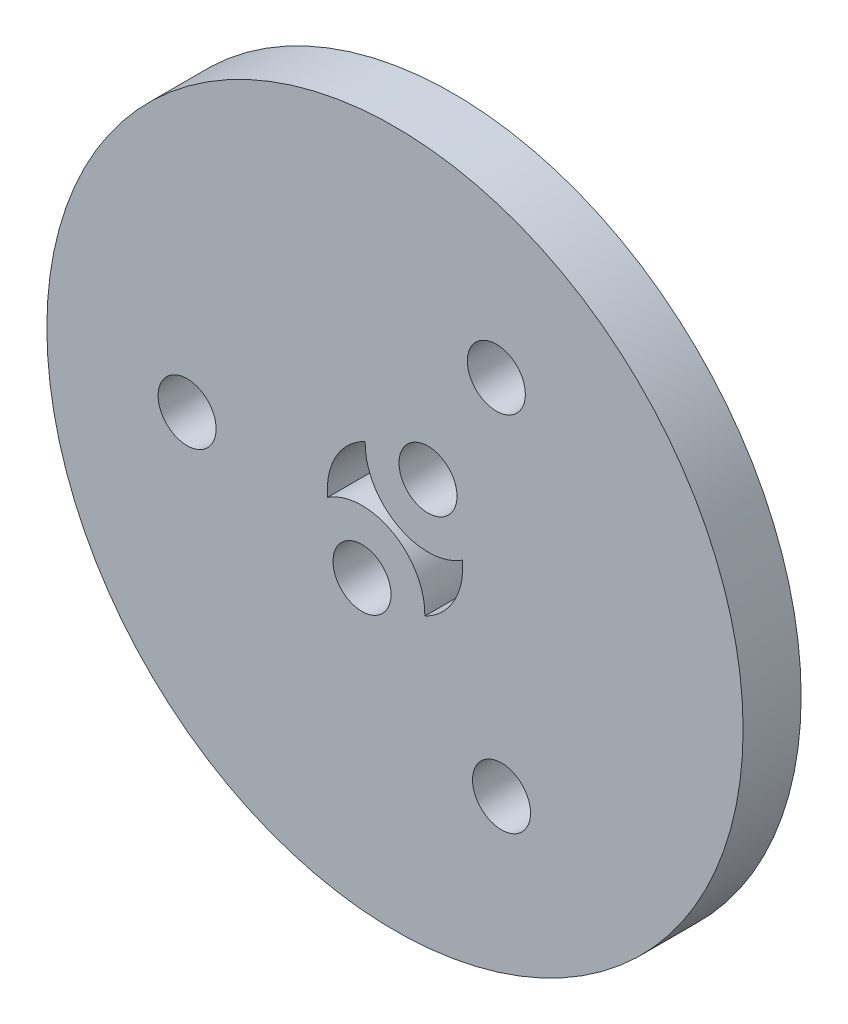
ISO-10303-21;
HEADER;
FILE_DESCRIPTION(('STEP AP214'),'2;1');
FILE_NAME('part.step','',(''),(''),'','','');
FILE_SCHEMA(('AUTOMOTIVE_DESIGN { 1 0 10303 214 1 1 1 1 }'));
ENDSEC;
DATA;
#1=APPLICATION_CONTEXT('core data for automotive mechanical design processes');
#2=APPLICATION_PROTOCOL_DEFINITION('international standard','automotive_design',2000,#1);
#3=PRODUCT_CONTEXT('',#1,'mechanical');
#4=PRODUCT('Part','Part','',(#3));
#5=PRODUCT_RELATED_PRODUCT_CATEGORY('part','',(#4));
#6=PRODUCT_DEFINITION_FORMATION('','',#4);
#7=PRODUCT_DEFINITION_CONTEXT('part definition',#1,'design');
#8=PRODUCT_DEFINITION('design','',#6,#7);
#9=PRODUCT_DEFINITION_SHAPE('','',#8);
#10=(LENGTH_UNIT() NAMED_UNIT(*) SI_UNIT(.MILLI.,.METRE.));
#11=(NAMED_UNIT(*) PLANE_ANGLE_UNIT() SI_UNIT($,.RADIAN.));
#12=(NAMED_UNIT(*) SI_UNIT($,.STERADIAN.) SOLID_ANGLE_UNIT());
#13=UNCERTAINTY_MEASURE_WITH_UNIT(LENGTH_MEASURE(1.E-05),#10,'distance_accuracy_value','');
#14=(GEOMETRIC_REPRESENTATION_CONTEXT(3) GLOBAL_UNCERTAINTY_ASSIGNED_CONTEXT((#13)) GLOBAL_UNIT_ASSIGNED_CONTEXT((#10,
#11,#12)) REPRESENTATION_CONTEXT('',''));
#15=CARTESIAN_POINT('',(0.,0.,0.));
#16=DIRECTION('',(0.,0.,1.));
#17=DIRECTION('',(1.,0.,0.));
#18=AXIS2_PLACEMENT_3D('',#15,#16,#17);
#19=CARTESIAN_POINT('',(0.,0.,3.));
#20=DIRECTION('',(0.,0.,1.));
#21=DIRECTION('',(1.,0.,0.));
#22=AXIS2_PLACEMENT_3D('',#19,#20,#21);
#23=PLANE('',#22);
#24=CARTESIAN_POINT('',(-1.70619408974937,-3.05596166993376,3.));
#25=DIRECTION('',(0.,0.,1.));
#26=DIRECTION('',(1.,0.,0.));
#27=AXIS2_PLACEMENT_3D('',#24,#25,#26);
#28=CIRCLE('',#27,1.5);
#29=CARTESIAN_POINT('',(-0.206194089749367,-3.05596166993376,3.));
#30=VERTEX_POINT('',#29);
#31=EDGE_CURVE('E116',#30,#30,#28,.T.);
#32=ORIENTED_EDGE('',*,*,#31,.F.);
#33=EDGE_LOOP('',(#32));
#34=FACE_BOUND('',#33,.T.);
#35=CARTESIAN_POINT('',(5.24045327565877,9.38616798622511,3.));
#36=DIRECTION('',(0.,0.,1.));
#37=DIRECTION('',(1.,0.,0.));
#38=AXIS2_PLACEMENT_3D('',#35,#36,#37);
#39=CIRCLE('',#38,1.49999999999964);
#40=CARTESIAN_POINT('',(6.74045327565841,9.38616798622511,3.));
#41=VERTEX_POINT('',#40);
#42=EDGE_CURVE('E128',#41,#41,#39,.T.);
#43=ORIENTED_EDGE('',*,*,#42,.F.);
#44=EDGE_LOOP('',(#43));
#45=FACE_BOUND('',#44,.T.);
#46=CARTESIAN_POINT('',(0.,0.,3.));
#47=DIRECTION('',(0.,0.,1.));
#48=DIRECTION('',(1.,0.,0.));
#49=AXIS2_PLACEMENT_3D('',#46,#47,#48);
#50=CIRCLE('',#49,18.);
#51=CARTESIAN_POINT('',(18.,0.,3.));
#52=VERTEX_POINT('',#51);
#53=EDGE_CURVE('E11',#52,#52,#50,.T.);
#54=ORIENTED_EDGE('',*,*,#53,.T.);
#55=EDGE_LOOP('',(#54));
#56=FACE_BOUND('',#55,.T.);
#57=CARTESIAN_POINT('',(5.5084332824298,-9.23144965717842,3.));
#58=DIRECTION('',(0.,0.,1.));
#59=DIRECTION('',(1.,0.,0.));
#60=AXIS2_PLACEMENT_3D('',#57,#58,#59);
#61=CIRCLE('',#60,1.49999999999968);
#62=CARTESIAN_POINT('',(7.00843328242948,-9.23144965717842,3.));
#63=VERTEX_POINT('',#62);
#64=EDGE_CURVE('E134',#63,#63,#61,.T.);
#65=ORIENTED_EDGE('',*,*,#64,.F.);
#66=EDGE_LOOP('',(#65));
#67=FACE_BOUND('',#66,.T.);
#68=CARTESIAN_POINT('',(-10.7488865580886,-0.15471832904669,3.));
#69=DIRECTION('',(0.,0.,1.));
#70=DIRECTION('',(1.,0.,0.));
#71=AXIS2_PLACEMENT_3D('',#68,#69,#70);
#72=CIRCLE('',#71,1.49999999999971);
#73=CARTESIAN_POINT('',(-9.24888655808885,-0.15471832904669,3.));
#74=VERTEX_POINT('',#73);
#75=EDGE_CURVE('E122',#74,#74,#72,.T.);
#76=ORIENTED_EDGE('',*,*,#75,.F.);
#77=EDGE_LOOP('',(#76));
#78=FACE_BOUND('',#77,.T.);
#79=CARTESIAN_POINT('',(1.70619408974937,3.05596166993376,3.));
#80=DIRECTION('',(0.,0.,1.));
#81=DIRECTION('',(1.,0.,0.));
#82=AXIS2_PLACEMENT_3D('',#79,#80,#81);
#83=CIRCLE('',#82,1.5);
#84=CARTESIAN_POINT('',(3.20619408974937,3.05596166993376,3.));
#85=VERTEX_POINT('',#84);
#86=EDGE_CURVE('E110',#85,#85,#83,.T.);
#87=ORIENTED_EDGE('',*,*,#86,.F.);
#88=EDGE_LOOP('',(#87));
#89=FACE_BOUND('',#88,.T.);
#90=CARTESIAN_POINT('',(1.70619408974937,3.05596166993376,3.));
#91=DIRECTION('',(0.,0.,-1.));
#92=DIRECTION('',(1.,0.,0.));
#93=AXIS2_PLACEMENT_3D('',#90,#91,#92);
#94=CIRCLE('',#93,3.25);
#95=CARTESIAN_POINT('',(3.48390634074488,0.335256034871325,3.));
#96=VERTEX_POINT('',#95);
#97=CARTESIAN_POINT('',(-1.54267531006065,3.14167994673698,3.));
#98=VERTEX_POINT('',#97);
#99=EDGE_CURVE('E82',#96,#98,#94,.T.);
#100=ORIENTED_EDGE('',*,*,#99,.F.);
#101=CARTESIAN_POINT('',(0.,0.,3.));
#102=DIRECTION('',(0.,0.,1.));
#103=DIRECTION('',(1.,0.,0.));
#104=AXIS2_PLACEMENT_3D('',#101,#102,#103);
#105=CIRCLE('',#104,3.5);
#106=CARTESIAN_POINT('',(1.54267531006065,-3.14167994673698,3.));
#107=VERTEX_POINT('',#106);
#108=EDGE_CURVE('E74',#107,#96,#105,.T.);
#109=ORIENTED_EDGE('',*,*,#108,.F.);
#110=CARTESIAN_POINT('',(-1.70619408974937,-3.05596166993376,3.));
#111=DIRECTION('',(0.,0.,-1.));
#112=DIRECTION('',(1.,0.,0.));
#113=AXIS2_PLACEMENT_3D('',#110,#111,#112);
#114=CIRCLE('',#113,3.25);
#115=CARTESIAN_POINT('',(-3.48390634074488,-0.335256034871325,3.));
#116=VERTEX_POINT('',#115);
#117=EDGE_CURVE('E96',#116,#107,#114,.T.);
#118=ORIENTED_EDGE('',*,*,#117,.F.);
#119=CARTESIAN_POINT('',(0.,0.,3.));
#120=DIRECTION('',(0.,0.,1.));
#121=DIRECTION('',(1.,0.,0.));
#122=AXIS2_PLACEMENT_3D('',#119,#120,#121);
#123=CIRCLE('',#122,3.5);
#124=EDGE_CURVE('E94',#98,#116,#123,.T.);
#125=ORIENTED_EDGE('',*,*,#124,.F.);
#126=EDGE_LOOP('',(#100,#109,#118,#125));
#127=FACE_BOUND('',#126,.T.);
#128=ADVANCED_FACE('F33',(#34,#45,#56,#67,#78,#89,#127),#23,.T.);
#129=CARTESIAN_POINT('',(0.,0.,0.));
#130=DIRECTION('',(0.,0.,1.));
#131=DIRECTION('',(1.,0.,0.));
#132=AXIS2_PLACEMENT_3D('',#129,#130,#131);
#133=PLANE('',#132);
#134=CARTESIAN_POINT('',(1.70619408974937,3.05596166993376,0.));
#135=DIRECTION('',(0.,0.,1.));
#136=DIRECTION('',(1.,0.,0.));
#137=AXIS2_PLACEMENT_3D('',#134,#135,#136);
#138=CIRCLE('',#137,1.5);
#139=CARTESIAN_POINT('',(3.20619408974937,3.05596166993376,0.));
#140=VERTEX_POINT('',#139);
#141=EDGE_CURVE('E90',#140,#140,#138,.T.);
#142=ORIENTED_EDGE('',*,*,#141,.T.);
#143=EDGE_LOOP('',(#142));
#144=FACE_BOUND('',#143,.T.);
#145=CARTESIAN_POINT('',(-1.70619408974937,-3.05596166993376,0.));
#146=DIRECTION('',(0.,0.,1.));
#147=DIRECTION('',(1.,0.,0.));
#148=AXIS2_PLACEMENT_3D('',#145,#146,#147);
#149=CIRCLE('',#148,1.5);
#150=CARTESIAN_POINT('',(-0.206194089749367,-3.05596166993376,0.));
#151=VERTEX_POINT('',#150);
#152=EDGE_CURVE('E113',#151,#151,#149,.T.);
#153=ORIENTED_EDGE('',*,*,#152,.T.);
#154=EDGE_LOOP('',(#153));
#155=FACE_BOUND('',#154,.T.);
#156=CARTESIAN_POINT('',(-10.7488865580886,-0.15471832904669,0.));
#157=DIRECTION('',(0.,0.,1.));
#158=DIRECTION('',(1.,0.,0.));
#159=AXIS2_PLACEMENT_3D('',#156,#157,#158);
#160=CIRCLE('',#159,1.49999999999971);
#161=CARTESIAN_POINT('',(-9.24888655808885,-0.15471832904669,0.));
#162=VERTEX_POINT('',#161);
#163=EDGE_CURVE('E119',#162,#162,#160,.T.);
#164=ORIENTED_EDGE('',*,*,#163,.T.);
#165=EDGE_LOOP('',(#164));
#166=FACE_BOUND('',#165,.T.);
#167=CARTESIAN_POINT('',(5.24045327565877,9.38616798622511,0.));
#168=DIRECTION('',(0.,0.,1.));
#169=DIRECTION('',(1.,0.,0.));
#170=AXIS2_PLACEMENT_3D('',#167,#168,#169);
#171=CIRCLE('',#170,1.49999999999964);
#172=CARTESIAN_POINT('',(6.74045327565841,9.38616798622511,0.));
#173=VERTEX_POINT('',#172);
#174=EDGE_CURVE('E125',#173,#173,#171,.T.);
#175=ORIENTED_EDGE('',*,*,#174,.T.);
#176=EDGE_LOOP('',(#175));
#177=FACE_BOUND('',#176,.T.);
#178=CARTESIAN_POINT('',(5.5084332824298,-9.23144965717842,0.));
#179=DIRECTION('',(0.,0.,1.));
#180=DIRECTION('',(1.,0.,0.));
#181=AXIS2_PLACEMENT_3D('',#178,#179,#180);
#182=CIRCLE('',#181,1.49999999999968);
#183=CARTESIAN_POINT('',(7.00843328242948,-9.23144965717842,0.));
#184=VERTEX_POINT('',#183);
#185=EDGE_CURVE('E131',#184,#184,#182,.T.);
#186=ORIENTED_EDGE('',*,*,#185,.T.);
#187=EDGE_LOOP('',(#186));
#188=FACE_BOUND('',#187,.T.);
#189=CARTESIAN_POINT('',(0.,0.,0.));
#190=DIRECTION('',(0.,0.,1.));
#191=DIRECTION('',(1.,0.,0.));
#192=AXIS2_PLACEMENT_3D('',#189,#190,#191);
#193=CIRCLE('',#192,18.);
#194=CARTESIAN_POINT('',(18.,0.,0.));
#195=VERTEX_POINT('',#194);
#196=EDGE_CURVE('E37',#195,#195,#193,.T.);
#197=ORIENTED_EDGE('',*,*,#196,.F.);
#198=EDGE_LOOP('',(#197));
#199=FACE_BOUND('',#198,.T.);
#200=CARTESIAN_POINT('',(0.,0.,0.));
#201=DIRECTION('',(0.,0.,1.));
#202=DIRECTION('',(1.,0.,0.));
#203=AXIS2_PLACEMENT_3D('',#200,#201,#202);
#204=CIRCLE('',#203,3.5);
#205=CARTESIAN_POINT('',(1.54267531006065,-3.14167994673698,0.));
#206=VERTEX_POINT('',#205);
#207=CARTESIAN_POINT('',(3.48390634074488,0.335256034871325,0.));
#208=VERTEX_POINT('',#207);
#209=EDGE_CURVE('E56',#206,#208,#204,.T.);
#210=ORIENTED_EDGE('',*,*,#209,.T.);
#211=CARTESIAN_POINT('',(1.70619408974937,3.05596166993376,0.));
#212=DIRECTION('',(0.,0.,-1.));
#213=DIRECTION('',(1.,0.,0.));
#214=AXIS2_PLACEMENT_3D('',#211,#212,#213);
#215=CIRCLE('',#214,3.25);
#216=CARTESIAN_POINT('',(-1.54267531006065,3.14167994673698,0.));
#217=VERTEX_POINT('',#216);
#218=EDGE_CURVE('E89',#208,#217,#215,.T.);
#219=ORIENTED_EDGE('',*,*,#218,.T.);
#220=CARTESIAN_POINT('',(0.,0.,0.));
#221=DIRECTION('',(0.,0.,1.));
#222=DIRECTION('',(1.,0.,0.));
#223=AXIS2_PLACEMENT_3D('',#220,#221,#222);
#224=CIRCLE('',#223,3.5);
#225=CARTESIAN_POINT('',(-3.48390634074488,-0.335256034871326,0.));
#226=VERTEX_POINT('',#225);
#227=EDGE_CURVE('E102',#217,#226,#224,.T.);
#228=ORIENTED_EDGE('',*,*,#227,.T.);
#229=CARTESIAN_POINT('',(-1.70619408974937,-3.05596166993376,0.));
#230=DIRECTION('',(0.,0.,-1.));
#231=DIRECTION('',(1.,0.,0.));
#232=AXIS2_PLACEMENT_3D('',#229,#230,#231);
#233=CIRCLE('',#232,3.25);
#234=EDGE_CURVE('E83',#226,#206,#233,.T.);
#235=ORIENTED_EDGE('',*,*,#234,.T.);
#236=EDGE_LOOP('',(#210,#219,#228,#235));
#237=FACE_BOUND('',#236,.T.);
#238=ADVANCED_FACE('F140',(#144,#155,#166,#177,#188,#199,#237),#133,.F.);
#239=CARTESIAN_POINT('',(0.,0.,3.));
#240=DIRECTION('',(0.,0.,-1.));
#241=DIRECTION('',(-1.,0.,0.));
#242=AXIS2_PLACEMENT_3D('',#239,#240,#241);
#243=CYLINDRICAL_SURFACE('',#242,18.);
#244=ORIENTED_EDGE('',*,*,#53,.F.);
#245=EDGE_LOOP('',(#244));
#246=FACE_BOUND('',#245,.T.);
#247=ORIENTED_EDGE('',*,*,#196,.T.);
#248=EDGE_LOOP('',(#247));
#249=FACE_BOUND('',#248,.T.);
#250=ADVANCED_FACE('F35',(#246,#249),#243,.T.);
#251=CARTESIAN_POINT('',(5.5084332824298,-9.23144965717842,3.));
#252=DIRECTION('',(0.,0.,-1.));
#253=DIRECTION('',(-1.,0.,0.));
#254=AXIS2_PLACEMENT_3D('',#251,#252,#253);
#255=CYLINDRICAL_SURFACE('',#254,1.49999999999968);
#256=ORIENTED_EDGE('',*,*,#64,.T.);
#257=EDGE_LOOP('',(#256));
#258=FACE_BOUND('',#257,.T.);
#259=ORIENTED_EDGE('',*,*,#185,.F.);
#260=EDGE_LOOP('',(#259));
#261=FACE_BOUND('',#260,.T.);
#262=ADVANCED_FACE('F143',(#258,#261),#255,.F.);
#263=CARTESIAN_POINT('',(5.24045327565877,9.38616798622511,3.));
#264=DIRECTION('',(0.,0.,-1.));
#265=DIRECTION('',(-1.,0.,0.));
#266=AXIS2_PLACEMENT_3D('',#263,#264,#265);
#267=CYLINDRICAL_SURFACE('',#266,1.49999999999964);
#268=ORIENTED_EDGE('',*,*,#42,.T.);
#269=EDGE_LOOP('',(#268));
#270=FACE_BOUND('',#269,.T.);
#271=ORIENTED_EDGE('',*,*,#174,.F.);
#272=EDGE_LOOP('',(#271));
#273=FACE_BOUND('',#272,.T.);
#274=ADVANCED_FACE('F145',(#270,#273),#267,.F.);
#275=CARTESIAN_POINT('',(-10.7488865580886,-0.15471832904669,3.));
#276=DIRECTION('',(0.,0.,-1.));
#277=DIRECTION('',(-1.,0.,0.));
#278=AXIS2_PLACEMENT_3D('',#275,#276,#277);
#279=CYLINDRICAL_SURFACE('',#278,1.49999999999971);
#280=ORIENTED_EDGE('',*,*,#75,.T.);
#281=EDGE_LOOP('',(#280));
#282=FACE_BOUND('',#281,.T.);
#283=ORIENTED_EDGE('',*,*,#163,.F.);
#284=EDGE_LOOP('',(#283));
#285=FACE_BOUND('',#284,.T.);
#286=ADVANCED_FACE('F152',(#282,#285),#279,.F.);
#287=CARTESIAN_POINT('',(-1.70619408974937,-3.05596166993376,3.));
#288=DIRECTION('',(0.,0.,-1.));
#289=DIRECTION('',(-1.,0.,0.));
#290=AXIS2_PLACEMENT_3D('',#287,#288,#289);
#291=CYLINDRICAL_SURFACE('',#290,1.5);
#292=ORIENTED_EDGE('',*,*,#31,.T.);
#293=EDGE_LOOP('',(#292));
#294=FACE_BOUND('',#293,.T.);
#295=ORIENTED_EDGE('',*,*,#152,.F.);
#296=EDGE_LOOP('',(#295));
#297=FACE_BOUND('',#296,.T.);
#298=ADVANCED_FACE('F178',(#294,#297),#291,.F.);
#299=CARTESIAN_POINT('',(1.70619408974937,3.05596166993376,3.));
#300=DIRECTION('',(0.,0.,-1.));
#301=DIRECTION('',(-1.,0.,0.));
#302=AXIS2_PLACEMENT_3D('',#299,#300,#301);
#303=CYLINDRICAL_SURFACE('',#302,1.5);
#304=ORIENTED_EDGE('',*,*,#86,.T.);
#305=EDGE_LOOP('',(#304));
#306=FACE_BOUND('',#305,.T.);
#307=ORIENTED_EDGE('',*,*,#141,.F.);
#308=EDGE_LOOP('',(#307));
#309=FACE_BOUND('',#308,.T.);
#310=ADVANCED_FACE('F175',(#306,#309),#303,.F.);
#311=CARTESIAN_POINT('',(0.,0.,3.));
#312=DIRECTION('',(0.,0.,-1.));
#313=DIRECTION('',(-1.,0.,0.));
#314=AXIS2_PLACEMENT_3D('',#311,#312,#313);
#315=CYLINDRICAL_SURFACE('',#314,3.5);
#316=ORIENTED_EDGE('',*,*,#209,.F.);
#317=DIRECTION('',(0.,0.,-1.));
#318=VECTOR('',#317,1.);
#319=CARTESIAN_POINT('',(1.54267531006065,-3.14167994673698,3.));
#320=LINE('',#319,#318);
#321=EDGE_CURVE('E78',#107,#206,#320,.T.);
#322=ORIENTED_EDGE('',*,*,#321,.F.);
#323=ORIENTED_EDGE('',*,*,#108,.T.);
#324=DIRECTION('',(0.,0.,-1.));
#325=VECTOR('',#324,1.);
#326=CARTESIAN_POINT('',(3.48390634074488,0.335256034871325,3.));
#327=LINE('',#326,#325);
#328=EDGE_CURVE('E77',#96,#208,#327,.T.);
#329=ORIENTED_EDGE('',*,*,#328,.T.);
#330=EDGE_LOOP('',(#316,#322,#323,#329));
#331=FACE_BOUND('',#330,.T.);
#332=ADVANCED_FACE('F76',(#331),#315,.F.);
#333=CARTESIAN_POINT('',(1.70619408974937,3.05596166993376,3.));
#334=DIRECTION('',(0.,0.,-1.));
#335=DIRECTION('',(-1.,0.,0.));
#336=AXIS2_PLACEMENT_3D('',#333,#334,#335);
#337=CYLINDRICAL_SURFACE('',#336,3.25);
#338=ORIENTED_EDGE('',*,*,#218,.F.);
#339=ORIENTED_EDGE('',*,*,#328,.F.);
#340=ORIENTED_EDGE('',*,*,#99,.T.);
#341=DIRECTION('',(0.,0.,-1.));
#342=VECTOR('',#341,1.);
#343=CARTESIAN_POINT('',(-1.54267531006065,3.14167994673698,3.));
#344=LINE('',#343,#342);
#345=EDGE_CURVE('E91',#98,#217,#344,.T.);
#346=ORIENTED_EDGE('',*,*,#345,.T.);
#347=EDGE_LOOP('',(#338,#339,#340,#346));
#348=FACE_BOUND('',#347,.T.);
#349=ADVANCED_FACE('F86',(#348),#337,.T.);
#350=CARTESIAN_POINT('',(0.,0.,3.));
#351=DIRECTION('',(0.,0.,-1.));
#352=DIRECTION('',(-1.,0.,0.));
#353=AXIS2_PLACEMENT_3D('',#350,#351,#352);
#354=CYLINDRICAL_SURFACE('',#353,3.5);
#355=ORIENTED_EDGE('',*,*,#227,.F.);
#356=ORIENTED_EDGE('',*,*,#345,.F.);
#357=ORIENTED_EDGE('',*,*,#124,.T.);
#358=DIRECTION('',(0.,0.,-1.));
#359=VECTOR('',#358,1.);
#360=CARTESIAN_POINT('',(-3.48390634074488,-0.335256034871326,3.));
#361=LINE('',#360,#359);
#362=EDGE_CURVE('E48',#116,#226,#361,.T.);
#363=ORIENTED_EDGE('',*,*,#362,.T.);
#364=EDGE_LOOP('',(#355,#356,#357,#363));
#365=FACE_BOUND('',#364,.T.);
#366=ADVANCED_FACE('F202',(#365),#354,.F.);
#367=CARTESIAN_POINT('',(-1.70619408974937,-3.05596166993376,3.));
#368=DIRECTION('',(0.,0.,-1.));
#369=DIRECTION('',(-1.,0.,0.));
#370=AXIS2_PLACEMENT_3D('',#367,#368,#369);
#371=CYLINDRICAL_SURFACE('',#370,3.25);
#372=ORIENTED_EDGE('',*,*,#234,.F.);
#373=ORIENTED_EDGE('',*,*,#362,.F.);
#374=ORIENTED_EDGE('',*,*,#117,.T.);
#375=ORIENTED_EDGE('',*,*,#321,.T.);
#376=EDGE_LOOP('',(#372,#373,#374,#375));
#377=FACE_BOUND('',#376,.T.);
#378=ADVANCED_FACE('F205',(#377),#371,.T.);
#379=CLOSED_SHELL('',(#128,#238,#250,#262,#274,#286,#298,#310,#332,#349,#366,#378));
#380=MANIFOLD_SOLID_BREP('B2',#379);
#381=ADVANCED_BREP_SHAPE_REPRESENTATION('',(#18,#380),#14);
#382=SHAPE_DEFINITION_REPRESENTATION(#9,#381);
ENDSEC;
END-ISO-10303-21;
